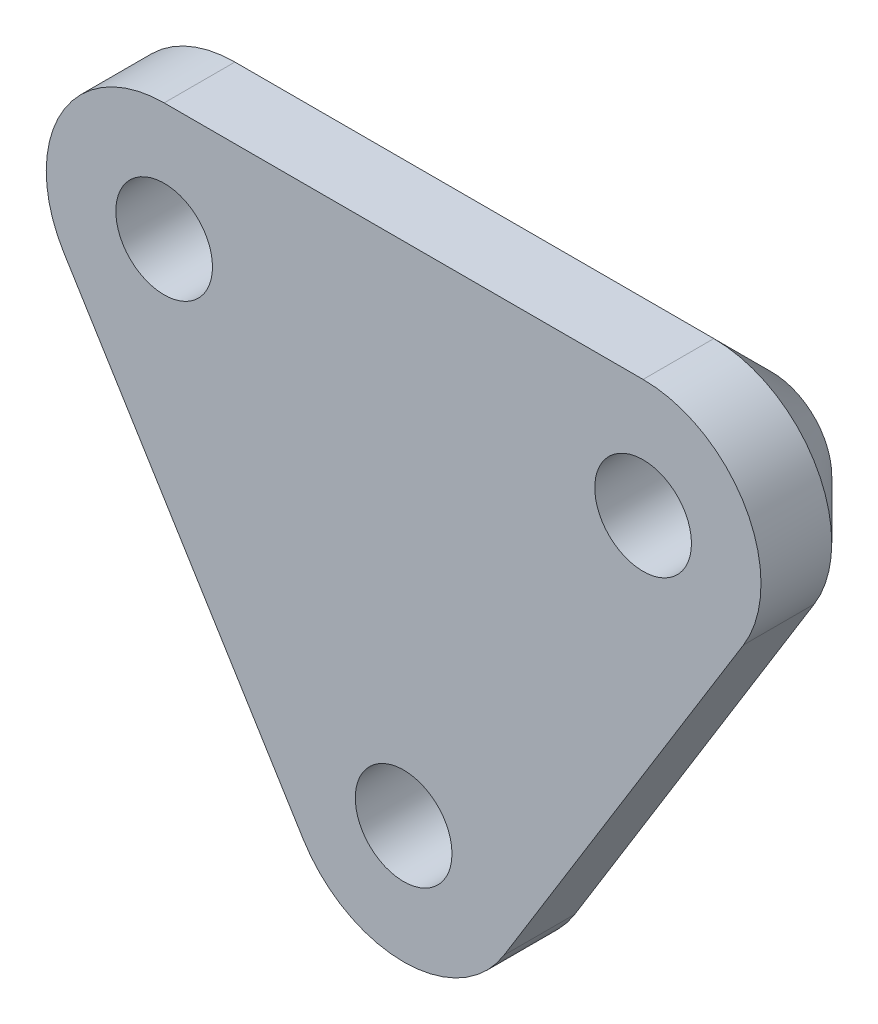
ISO-10303-21;
HEADER;
FILE_DESCRIPTION(('STEP AP214'),'2;1');
FILE_NAME('part.step','',(''),(''),'','','');
FILE_SCHEMA(('AUTOMOTIVE_DESIGN { 1 0 10303 214 1 1 1 1 }'));
ENDSEC;
DATA;
#1=APPLICATION_CONTEXT('core data for automotive mechanical design processes');
#2=APPLICATION_PROTOCOL_DEFINITION('international standard','automotive_design',2000,#1);
#3=PRODUCT_CONTEXT('',#1,'mechanical');
#4=PRODUCT('Part','Part','',(#3));
#5=PRODUCT_RELATED_PRODUCT_CATEGORY('part','',(#4));
#6=PRODUCT_DEFINITION_FORMATION('','',#4);
#7=PRODUCT_DEFINITION_CONTEXT('part definition',#1,'design');
#8=PRODUCT_DEFINITION('design','',#6,#7);
#9=PRODUCT_DEFINITION_SHAPE('','',#8);
#10=(LENGTH_UNIT() NAMED_UNIT(*) SI_UNIT(.MILLI.,.METRE.));
#11=(NAMED_UNIT(*) PLANE_ANGLE_UNIT() SI_UNIT($,.RADIAN.));
#12=(NAMED_UNIT(*) SI_UNIT($,.STERADIAN.) SOLID_ANGLE_UNIT());
#13=UNCERTAINTY_MEASURE_WITH_UNIT(LENGTH_MEASURE(1.E-05),#10,'distance_accuracy_value','');
#14=(GEOMETRIC_REPRESENTATION_CONTEXT(3) GLOBAL_UNCERTAINTY_ASSIGNED_CONTEXT((#13)) GLOBAL_UNIT_ASSIGNED_CONTEXT((#10,
#11,#12)) REPRESENTATION_CONTEXT('',''));
#15=CARTESIAN_POINT('',(0.,0.,0.));
#16=DIRECTION('',(0.,0.,1.));
#17=DIRECTION('',(1.,0.,0.));
#18=AXIS2_PLACEMENT_3D('',#15,#16,#17);
#19=CARTESIAN_POINT('',(-10.155,16.47,3.));
#20=DIRECTION('',(0.,0.,1.));
#21=DIRECTION('',(1.,0.,0.));
#22=AXIS2_PLACEMENT_3D('',#19,#20,#21);
#23=PLANE('',#22);
#24=CARTESIAN_POINT('',(10.155,16.47,3.));
#25=DIRECTION('',(0.,0.,1.));
#26=DIRECTION('',(1.,0.,0.));
#27=AXIS2_PLACEMENT_3D('',#24,#25,#26);
#28=CIRCLE('',#27,2.05);
#29=CARTESIAN_POINT('',(12.205,16.47,3.));
#30=VERTEX_POINT('',#29);
#31=EDGE_CURVE('E164',#30,#30,#28,.T.);
#32=ORIENTED_EDGE('',*,*,#31,.F.);
#33=EDGE_LOOP('',(#32));
#34=FACE_BOUND('',#33,.T.);
#35=CARTESIAN_POINT('',(-10.155,16.47,3.));
#36=DIRECTION('',(0.,0.,1.));
#37=DIRECTION('',(1.,0.,0.));
#38=AXIS2_PLACEMENT_3D('',#35,#36,#37);
#39=CIRCLE('',#38,5.);
#40=CARTESIAN_POINT('',(-10.155,21.47,3.));
#41=VERTEX_POINT('',#40);
#42=CARTESIAN_POINT('',(-14.411027514701,13.845837315617,3.));
#43=VERTEX_POINT('',#42);
#44=EDGE_CURVE('E134',#41,#43,#39,.T.);
#45=ORIENTED_EDGE('',*,*,#44,.T.);
#46=DIRECTION('',(0.524832536876604,-0.851205502940194,0.));
#47=VECTOR('',#46,1.);
#48=CARTESIAN_POINT('',(-14.411027514701,13.845837315617,3.));
#49=LINE('',#48,#47);
#50=CARTESIAN_POINT('',(-4.25602751470097,-2.62416268438302,3.));
#51=VERTEX_POINT('',#50);
#52=EDGE_CURVE('E90',#43,#51,#49,.T.);
#53=ORIENTED_EDGE('',*,*,#52,.T.);
#54=CARTESIAN_POINT('',(0.,0.,3.));
#55=DIRECTION('',(0.,0.,1.));
#56=DIRECTION('',(1.,0.,0.));
#57=AXIS2_PLACEMENT_3D('',#54,#55,#56);
#58=CIRCLE('',#57,5.);
#59=CARTESIAN_POINT('',(4.25602751470097,-2.62416268438302,3.));
#60=VERTEX_POINT('',#59);
#61=EDGE_CURVE('E106',#51,#60,#58,.T.);
#62=ORIENTED_EDGE('',*,*,#61,.T.);
#63=DIRECTION('',(0.524832536876604,0.851205502940194,0.));
#64=VECTOR('',#63,1.);
#65=CARTESIAN_POINT('',(4.25602751470097,-2.62416268438302,3.));
#66=LINE('',#65,#64);
#67=CARTESIAN_POINT('',(14.411027514701,13.845837315617,3.));
#68=VERTEX_POINT('',#67);
#69=EDGE_CURVE('E99',#60,#68,#66,.T.);
#70=ORIENTED_EDGE('',*,*,#69,.T.);
#71=CARTESIAN_POINT('',(10.155,16.47,3.));
#72=DIRECTION('',(0.,0.,1.));
#73=DIRECTION('',(1.,0.,0.));
#74=AXIS2_PLACEMENT_3D('',#71,#72,#73);
#75=CIRCLE('',#74,5.);
#76=CARTESIAN_POINT('',(10.155,21.47,3.));
#77=VERTEX_POINT('',#76);
#78=EDGE_CURVE('E103',#68,#77,#75,.T.);
#79=ORIENTED_EDGE('',*,*,#78,.T.);
#80=DIRECTION('',(-1.,0.,0.));
#81=VECTOR('',#80,1.);
#82=CARTESIAN_POINT('',(10.155,21.47,3.));
#83=LINE('',#82,#81);
#84=EDGE_CURVE('E60',#77,#41,#83,.T.);
#85=ORIENTED_EDGE('',*,*,#84,.T.);
#86=EDGE_LOOP('',(#45,#53,#62,#70,#79,#85));
#87=FACE_BOUND('',#86,.T.);
#88=CARTESIAN_POINT('',(-10.155,16.47,3.));
#89=DIRECTION('',(0.,0.,1.));
#90=DIRECTION('',(1.,0.,0.));
#91=AXIS2_PLACEMENT_3D('',#88,#89,#90);
#92=CIRCLE('',#91,2.05);
#93=CARTESIAN_POINT('',(-8.105,16.47,3.));
#94=VERTEX_POINT('',#93);
#95=EDGE_CURVE('E129',#94,#94,#92,.T.);
#96=ORIENTED_EDGE('',*,*,#95,.F.);
#97=EDGE_LOOP('',(#96));
#98=FACE_BOUND('',#97,.T.);
#99=CARTESIAN_POINT('',(0.,0.,3.));
#100=DIRECTION('',(0.,0.,1.));
#101=DIRECTION('',(1.,0.,0.));
#102=AXIS2_PLACEMENT_3D('',#99,#100,#101);
#103=CIRCLE('',#102,2.05);
#104=CARTESIAN_POINT('',(2.05,0.,3.));
#105=VERTEX_POINT('',#104);
#106=EDGE_CURVE('E160',#105,#105,#103,.T.);
#107=ORIENTED_EDGE('',*,*,#106,.F.);
#108=EDGE_LOOP('',(#107));
#109=FACE_BOUND('',#108,.T.);
#110=ADVANCED_FACE('F41',(#34,#87,#98,#109),#23,.T.);
#111=CARTESIAN_POINT('',(-10.155,16.47,0.));
#112=DIRECTION('',(0.,0.,1.));
#113=DIRECTION('',(1.,0.,0.));
#114=AXIS2_PLACEMENT_3D('',#111,#112,#113);
#115=PLANE('',#114);
#116=CARTESIAN_POINT('',(0.,0.,0.));
#117=DIRECTION('',(0.,0.,-1.));
#118=DIRECTION('',(-1.,0.,0.));
#119=AXIS2_PLACEMENT_3D('',#116,#117,#118);
#120=CIRCLE('',#119,5.);
#121=CARTESIAN_POINT('',(-4.25602751470097,-2.62416268438302,0.));
#122=VERTEX_POINT('',#121);
#123=CARTESIAN_POINT('',(4.25602751470097,-2.62416268438302,0.));
#124=VERTEX_POINT('',#123);
#125=EDGE_CURVE('E75',#122,#124,#120,.T.);
#126=ORIENTED_EDGE('',*,*,#125,.F.);
#127=DIRECTION('',(0.524832536876604,-0.851205502940194,0.));
#128=VECTOR('',#127,1.);
#129=CARTESIAN_POINT('',(-14.411027514701,13.845837315617,0.));
#130=LINE('',#129,#128);
#131=CARTESIAN_POINT('',(-14.411027514701,13.845837315617,0.));
#132=VERTEX_POINT('',#131);
#133=EDGE_CURVE('E127',#132,#122,#130,.T.);
#134=ORIENTED_EDGE('',*,*,#133,.F.);
#135=CARTESIAN_POINT('',(-10.155,16.47,0.));
#136=DIRECTION('',(0.,0.,-1.));
#137=DIRECTION('',(-1.,0.,0.));
#138=AXIS2_PLACEMENT_3D('',#135,#136,#137);
#139=CIRCLE('',#138,5.);
#140=CARTESIAN_POINT('',(-10.155,21.47,0.));
#141=VERTEX_POINT('',#140);
#142=EDGE_CURVE('E157',#141,#132,#139,.T.);
#143=ORIENTED_EDGE('',*,*,#142,.F.);
#144=DIRECTION('',(-1.,0.,0.));
#145=VECTOR('',#144,1.);
#146=CARTESIAN_POINT('',(10.155,21.47,0.));
#147=LINE('',#146,#145);
#148=CARTESIAN_POINT('',(10.155,21.47,0.));
#149=VERTEX_POINT('',#148);
#150=EDGE_CURVE('E131',#149,#141,#147,.T.);
#151=ORIENTED_EDGE('',*,*,#150,.F.);
#152=CARTESIAN_POINT('',(10.155,16.47,0.));
#153=DIRECTION('',(0.,0.,-1.));
#154=DIRECTION('',(-1.,0.,0.));
#155=AXIS2_PLACEMENT_3D('',#152,#153,#154);
#156=CIRCLE('',#155,5.);
#157=CARTESIAN_POINT('',(14.411027514701,13.845837315617,0.));
#158=VERTEX_POINT('',#157);
#159=EDGE_CURVE('E81',#158,#149,#156,.T.);
#160=ORIENTED_EDGE('',*,*,#159,.F.);
#161=DIRECTION('',(0.524832536876604,0.851205502940194,0.));
#162=VECTOR('',#161,1.);
#163=CARTESIAN_POINT('',(4.25602751470097,-2.62416268438302,0.));
#164=LINE('',#163,#162);
#165=EDGE_CURVE('E114',#124,#158,#164,.T.);
#166=ORIENTED_EDGE('',*,*,#165,.F.);
#167=EDGE_LOOP('',(#126,#134,#143,#151,#160,#166));
#168=FACE_BOUND('',#167,.T.);
#169=ADVANCED_FACE('F156',(#168),#115,.F.);
#170=CARTESIAN_POINT('',(-10.155,16.47,3.));
#171=DIRECTION('',(0.,0.,-1.));
#172=DIRECTION('',(-1.,0.,0.));
#173=AXIS2_PLACEMENT_3D('',#170,#171,#172);
#174=CYLINDRICAL_SURFACE('',#173,5.);
#175=DIRECTION('',(0.,0.,-1.));
#176=VECTOR('',#175,1.);
#177=CARTESIAN_POINT('',(-10.155,21.47,3.));
#178=LINE('',#177,#176);
#179=EDGE_CURVE('E123',#41,#141,#178,.T.);
#180=ORIENTED_EDGE('',*,*,#179,.T.);
#181=CARTESIAN_POINT('',(-10.155,16.47,0.));
#182=DIRECTION('',(0.,0.,-1.));
#183=DIRECTION('',(-1.,0.,0.));
#184=AXIS2_PLACEMENT_3D('',#181,#182,#183);
#185=CIRCLE('',#184,5.);
#186=EDGE_CURVE('E52',#141,#132,#185,.F.);
#187=ORIENTED_EDGE('',*,*,#186,.T.);
#188=DIRECTION('',(0.,0.,-1.));
#189=VECTOR('',#188,1.);
#190=CARTESIAN_POINT('',(-14.411027514701,13.845837315617,3.));
#191=LINE('',#190,#189);
#192=EDGE_CURVE('E142',#43,#132,#191,.T.);
#193=ORIENTED_EDGE('',*,*,#192,.F.);
#194=ORIENTED_EDGE('',*,*,#44,.F.);
#195=EDGE_LOOP('',(#180,#187,#193,#194));
#196=FACE_BOUND('',#195,.T.);
#197=ADVANCED_FACE('F150',(#196),#174,.T.);
#198=CARTESIAN_POINT('',(-14.411027514701,13.845837315617,3.));
#199=DIRECTION('',(0.851205502940194,0.524832536876604,0.));
#200=DIRECTION('',(-0.524832536876604,0.851205502940194,0.));
#201=AXIS2_PLACEMENT_3D('',#198,#199,#200);
#202=PLANE('',#201);
#203=ORIENTED_EDGE('',*,*,#133,.T.);
#204=DIRECTION('',(0.,0.,-1.));
#205=VECTOR('',#204,1.);
#206=CARTESIAN_POINT('',(-4.25602751470097,-2.62416268438302,3.));
#207=LINE('',#206,#205);
#208=EDGE_CURVE('E139',#51,#122,#207,.T.);
#209=ORIENTED_EDGE('',*,*,#208,.F.);
#210=ORIENTED_EDGE('',*,*,#52,.F.);
#211=ORIENTED_EDGE('',*,*,#192,.T.);
#212=EDGE_LOOP('',(#203,#209,#210,#211));
#213=FACE_BOUND('',#212,.T.);
#214=ADVANCED_FACE('F158',(#213),#202,.F.);
#215=CARTESIAN_POINT('',(0.,0.,3.));
#216=DIRECTION('',(0.,0.,-1.));
#217=DIRECTION('',(-1.,0.,0.));
#218=AXIS2_PLACEMENT_3D('',#215,#216,#217);
#219=CYLINDRICAL_SURFACE('',#218,5.);
#220=ORIENTED_EDGE('',*,*,#208,.T.);
#221=CARTESIAN_POINT('',(0.,0.,0.));
#222=DIRECTION('',(0.,0.,-1.));
#223=DIRECTION('',(-1.,0.,0.));
#224=AXIS2_PLACEMENT_3D('',#221,#222,#223);
#225=CIRCLE('',#224,5.);
#226=EDGE_CURVE('E144',#122,#124,#225,.F.);
#227=ORIENTED_EDGE('',*,*,#226,.T.);
#228=DIRECTION('',(0.,0.,-1.));
#229=VECTOR('',#228,1.);
#230=CARTESIAN_POINT('',(4.25602751470097,-2.62416268438302,3.));
#231=LINE('',#230,#229);
#232=EDGE_CURVE('E117',#60,#124,#231,.T.);
#233=ORIENTED_EDGE('',*,*,#232,.F.);
#234=ORIENTED_EDGE('',*,*,#61,.F.);
#235=EDGE_LOOP('',(#220,#227,#233,#234));
#236=FACE_BOUND('',#235,.T.);
#237=ADVANCED_FACE('F179',(#236),#219,.T.);
#238=CARTESIAN_POINT('',(4.25602751470097,-2.62416268438302,3.));
#239=DIRECTION('',(-0.851205502940194,0.524832536876604,0.));
#240=DIRECTION('',(-0.524832536876604,-0.851205502940194,0.));
#241=AXIS2_PLACEMENT_3D('',#238,#239,#240);
#242=PLANE('',#241);
#243=ORIENTED_EDGE('',*,*,#165,.T.);
#244=DIRECTION('',(0.,0.,-1.));
#245=VECTOR('',#244,1.);
#246=CARTESIAN_POINT('',(14.411027514701,13.845837315617,3.));
#247=LINE('',#246,#245);
#248=EDGE_CURVE('E112',#68,#158,#247,.T.);
#249=ORIENTED_EDGE('',*,*,#248,.F.);
#250=ORIENTED_EDGE('',*,*,#69,.F.);
#251=ORIENTED_EDGE('',*,*,#232,.T.);
#252=EDGE_LOOP('',(#243,#249,#250,#251));
#253=FACE_BOUND('',#252,.T.);
#254=ADVANCED_FACE('F113',(#253),#242,.F.);
#255=CARTESIAN_POINT('',(10.155,16.47,3.));
#256=DIRECTION('',(0.,0.,-1.));
#257=DIRECTION('',(-1.,0.,0.));
#258=AXIS2_PLACEMENT_3D('',#255,#256,#257);
#259=CYLINDRICAL_SURFACE('',#258,5.);
#260=ORIENTED_EDGE('',*,*,#248,.T.);
#261=CARTESIAN_POINT('',(10.155,16.47,0.));
#262=DIRECTION('',(0.,0.,-1.));
#263=DIRECTION('',(-1.,0.,0.));
#264=AXIS2_PLACEMENT_3D('',#261,#262,#263);
#265=CIRCLE('',#264,5.);
#266=EDGE_CURVE('E11',#158,#149,#265,.F.);
#267=ORIENTED_EDGE('',*,*,#266,.T.);
#268=DIRECTION('',(0.,0.,-1.));
#269=VECTOR('',#268,1.);
#270=CARTESIAN_POINT('',(10.155,21.47,3.));
#271=LINE('',#270,#269);
#272=EDGE_CURVE('E118',#77,#149,#271,.T.);
#273=ORIENTED_EDGE('',*,*,#272,.F.);
#274=ORIENTED_EDGE('',*,*,#78,.F.);
#275=EDGE_LOOP('',(#260,#267,#273,#274));
#276=FACE_BOUND('',#275,.T.);
#277=ADVANCED_FACE('F120',(#276),#259,.T.);
#278=CARTESIAN_POINT('',(10.155,21.47,3.));
#279=DIRECTION('',(0.,-1.,0.));
#280=DIRECTION('',(0.,0.,-1.));
#281=AXIS2_PLACEMENT_3D('',#278,#279,#280);
#282=PLANE('',#281);
#283=ORIENTED_EDGE('',*,*,#150,.T.);
#284=ORIENTED_EDGE('',*,*,#179,.F.);
#285=ORIENTED_EDGE('',*,*,#84,.F.);
#286=ORIENTED_EDGE('',*,*,#272,.T.);
#287=EDGE_LOOP('',(#283,#284,#285,#286));
#288=FACE_BOUND('',#287,.T.);
#289=ADVANCED_FACE('F185',(#288),#282,.F.);
#290=CARTESIAN_POINT('',(-10.155,16.47,3.));
#291=DIRECTION('',(0.,0.,-1.));
#292=DIRECTION('',(-1.,0.,0.));
#293=AXIS2_PLACEMENT_3D('',#290,#291,#292);
#294=CYLINDRICAL_SURFACE('',#293,2.05);
#295=CARTESIAN_POINT('',(-10.155,16.47,-2.45));
#296=DIRECTION('',(0.,0.,1.));
#297=DIRECTION('',(1.,0.,0.));
#298=AXIS2_PLACEMENT_3D('',#295,#296,#297);
#299=CIRCLE('',#298,2.05);
#300=CARTESIAN_POINT('',(-8.105,16.47,-2.45));
#301=VERTEX_POINT('',#300);
#302=EDGE_CURVE('E161',#301,#301,#299,.T.);
#303=ORIENTED_EDGE('',*,*,#302,.F.);
#304=EDGE_LOOP('',(#303));
#305=FACE_BOUND('',#304,.T.);
#306=ORIENTED_EDGE('',*,*,#95,.T.);
#307=EDGE_LOOP('',(#306));
#308=FACE_BOUND('',#307,.T.);
#309=ADVANCED_FACE('F187',(#305,#308),#294,.F.);
#310=CARTESIAN_POINT('',(10.155,16.47,3.));
#311=DIRECTION('',(0.,0.,-1.));
#312=DIRECTION('',(-1.,0.,0.));
#313=AXIS2_PLACEMENT_3D('',#310,#311,#312);
#314=CYLINDRICAL_SURFACE('',#313,2.05);
#315=CARTESIAN_POINT('',(10.155,16.47,-2.45));
#316=DIRECTION('',(0.,0.,1.));
#317=DIRECTION('',(1.,0.,0.));
#318=AXIS2_PLACEMENT_3D('',#315,#316,#317);
#319=CIRCLE('',#318,2.05);
#320=CARTESIAN_POINT('',(12.205,16.47,-2.45));
#321=VERTEX_POINT('',#320);
#322=EDGE_CURVE('E167',#321,#321,#319,.T.);
#323=ORIENTED_EDGE('',*,*,#322,.F.);
#324=EDGE_LOOP('',(#323));
#325=FACE_BOUND('',#324,.T.);
#326=ORIENTED_EDGE('',*,*,#31,.T.);
#327=EDGE_LOOP('',(#326));
#328=FACE_BOUND('',#327,.T.);
#329=ADVANCED_FACE('F193',(#325,#328),#314,.F.);
#330=CARTESIAN_POINT('',(0.,0.,3.));
#331=DIRECTION('',(0.,0.,-1.));
#332=DIRECTION('',(-1.,0.,0.));
#333=AXIS2_PLACEMENT_3D('',#330,#331,#332);
#334=CYLINDRICAL_SURFACE('',#333,2.05);
#335=CARTESIAN_POINT('',(0.,0.,-2.45));
#336=DIRECTION('',(0.,0.,1.));
#337=DIRECTION('',(1.,0.,0.));
#338=AXIS2_PLACEMENT_3D('',#335,#336,#337);
#339=CIRCLE('',#338,2.05);
#340=CARTESIAN_POINT('',(2.05,0.,-2.45));
#341=VERTEX_POINT('',#340);
#342=EDGE_CURVE('E234',#341,#341,#339,.T.);
#343=ORIENTED_EDGE('',*,*,#342,.F.);
#344=EDGE_LOOP('',(#343));
#345=FACE_BOUND('',#344,.T.);
#346=ORIENTED_EDGE('',*,*,#106,.T.);
#347=EDGE_LOOP('',(#346));
#348=FACE_BOUND('',#347,.T.);
#349=ADVANCED_FACE('F208',(#345,#348),#334,.F.);
#350=CARTESIAN_POINT('',(0.,0.,-2.95));
#351=DIRECTION('',(0.,0.,1.));
#352=DIRECTION('',(1.,0.,0.));
#353=AXIS2_PLACEMENT_3D('',#350,#351,#352);
#354=CONICAL_SURFACE('',#353,2.05,0.785398163397447);
#355=CARTESIAN_POINT('',(0.,0.,-2.45));
#356=DIRECTION('',(0.,0.,1.));
#357=DIRECTION('',(1.,0.,0.));
#358=AXIS2_PLACEMENT_3D('',#355,#356,#357);
#359=CIRCLE('',#358,2.54999999999999);
#360=CARTESIAN_POINT('',(2.54999999999999,0.,-2.45));
#361=VERTEX_POINT('',#360);
#362=EDGE_CURVE('E237',#361,#361,#359,.F.);
#363=ORIENTED_EDGE('',*,*,#362,.F.);
#364=EDGE_LOOP('',(#363));
#365=FACE_BOUND('',#364,.T.);
#366=ORIENTED_EDGE('',*,*,#125,.T.);
#367=ORIENTED_EDGE('',*,*,#226,.F.);
#368=EDGE_LOOP('',(#366,#367));
#369=FACE_BOUND('',#368,.T.);
#370=ADVANCED_FACE('F212',(#365,#369),#354,.T.);
#371=CARTESIAN_POINT('',(-10.155,16.47,-2.95));
#372=DIRECTION('',(0.,0.,1.));
#373=DIRECTION('',(1.,0.,0.));
#374=AXIS2_PLACEMENT_3D('',#371,#372,#373);
#375=CONICAL_SURFACE('',#374,2.05,0.785398163397447);
#376=CARTESIAN_POINT('',(-10.155,16.47,-2.45));
#377=DIRECTION('',(0.,0.,1.));
#378=DIRECTION('',(1.,0.,0.));
#379=AXIS2_PLACEMENT_3D('',#376,#377,#378);
#380=CIRCLE('',#379,2.54999999999999);
#381=CARTESIAN_POINT('',(-7.605,16.47,-2.45));
#382=VERTEX_POINT('',#381);
#383=EDGE_CURVE('E239',#382,#382,#380,.F.);
#384=ORIENTED_EDGE('',*,*,#383,.F.);
#385=EDGE_LOOP('',(#384));
#386=FACE_BOUND('',#385,.T.);
#387=ORIENTED_EDGE('',*,*,#186,.F.);
#388=ORIENTED_EDGE('',*,*,#142,.T.);
#389=EDGE_LOOP('',(#387,#388));
#390=FACE_BOUND('',#389,.T.);
#391=ADVANCED_FACE('F159',(#386,#390),#375,.T.);
#392=CARTESIAN_POINT('',(10.155,16.47,-2.95));
#393=DIRECTION('',(0.,0.,1.));
#394=DIRECTION('',(1.,0.,0.));
#395=AXIS2_PLACEMENT_3D('',#392,#393,#394);
#396=CONICAL_SURFACE('',#395,2.05000000000001,0.785398163397445);
#397=CARTESIAN_POINT('',(10.155,16.47,-2.45));
#398=DIRECTION('',(0.,0.,1.));
#399=DIRECTION('',(1.,0.,0.));
#400=AXIS2_PLACEMENT_3D('',#397,#398,#399);
#401=CIRCLE('',#400,2.55000000000001);
#402=CARTESIAN_POINT('',(12.705,16.47,-2.45));
#403=VERTEX_POINT('',#402);
#404=EDGE_CURVE('E46',#403,#403,#401,.F.);
#405=ORIENTED_EDGE('',*,*,#404,.F.);
#406=EDGE_LOOP('',(#405));
#407=FACE_BOUND('',#406,.T.);
#408=ORIENTED_EDGE('',*,*,#159,.T.);
#409=ORIENTED_EDGE('',*,*,#266,.F.);
#410=EDGE_LOOP('',(#408,#409));
#411=FACE_BOUND('',#410,.T.);
#412=ADVANCED_FACE('F44',(#407,#411),#396,.T.);
#413=CARTESIAN_POINT('',(0.,0.,-2.45));
#414=DIRECTION('',(0.,0.,1.));
#415=DIRECTION('',(1.,0.,0.));
#416=AXIS2_PLACEMENT_3D('',#413,#414,#415);
#417=PLANE('',#416);
#418=ORIENTED_EDGE('',*,*,#322,.T.);
#419=EDGE_LOOP('',(#418));
#420=FACE_BOUND('',#419,.T.);
#421=ORIENTED_EDGE('',*,*,#404,.T.);
#422=EDGE_LOOP('',(#421));
#423=FACE_BOUND('',#422,.T.);
#424=ADVANCED_FACE('F214',(#420,#423),#417,.F.);
#425=ORIENTED_EDGE('',*,*,#302,.T.);
#426=EDGE_LOOP('',(#425));
#427=FACE_BOUND('',#426,.T.);
#428=ORIENTED_EDGE('',*,*,#383,.T.);
#429=EDGE_LOOP('',(#428));
#430=FACE_BOUND('',#429,.T.);
#431=ADVANCED_FACE('F216',(#427,#430),#417,.F.);
#432=ORIENTED_EDGE('',*,*,#342,.T.);
#433=EDGE_LOOP('',(#432));
#434=FACE_BOUND('',#433,.T.);
#435=ORIENTED_EDGE('',*,*,#362,.T.);
#436=EDGE_LOOP('',(#435));
#437=FACE_BOUND('',#436,.T.);
#438=ADVANCED_FACE('F218',(#434,#437),#417,.F.);
#439=CLOSED_SHELL('',(#110,#169,#197,#214,#237,#254,#277,#289,#309,#329,#349,#370,#391,#412,
#424,#431,#438));
#440=MANIFOLD_SOLID_BREP('B2',#439);
#441=ADVANCED_BREP_SHAPE_REPRESENTATION('',(#18,#440),#14);
#442=SHAPE_DEFINITION_REPRESENTATION(#9,#441);
ENDSEC;
END-ISO-10303-21;
